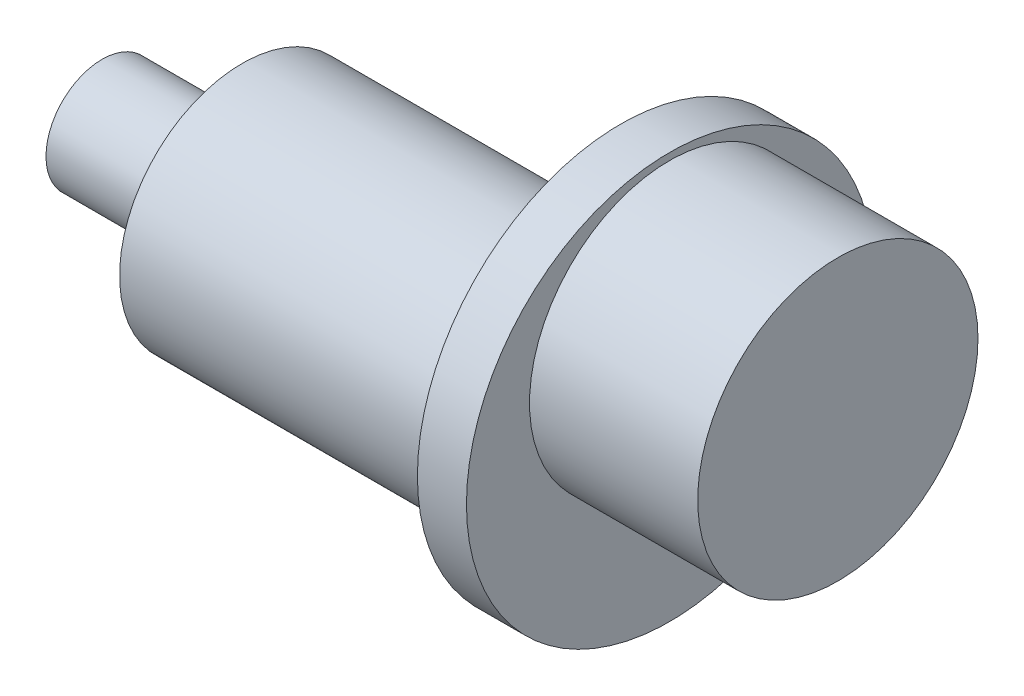
ISO-10303-21;
HEADER;
FILE_DESCRIPTION(('STEP AP214'),'2;1');
FILE_NAME('part.step','',(''),(''),'','','');
FILE_SCHEMA(('AUTOMOTIVE_DESIGN { 1 0 10303 214 1 1 1 1 }'));
ENDSEC;
DATA;
#1=APPLICATION_CONTEXT('core data for automotive mechanical design processes');
#2=APPLICATION_PROTOCOL_DEFINITION('international standard','automotive_design',2000,#1);
#3=PRODUCT_CONTEXT('',#1,'mechanical');
#4=PRODUCT('Part','Part','',(#3));
#5=PRODUCT_RELATED_PRODUCT_CATEGORY('part','',(#4));
#6=PRODUCT_DEFINITION_FORMATION('','',#4);
#7=PRODUCT_DEFINITION_CONTEXT('part definition',#1,'design');
#8=PRODUCT_DEFINITION('design','',#6,#7);
#9=PRODUCT_DEFINITION_SHAPE('','',#8);
#10=(LENGTH_UNIT() NAMED_UNIT(*) SI_UNIT(.MILLI.,.METRE.));
#11=(NAMED_UNIT(*) PLANE_ANGLE_UNIT() SI_UNIT($,.RADIAN.));
#12=(NAMED_UNIT(*) SI_UNIT($,.STERADIAN.) SOLID_ANGLE_UNIT());
#13=UNCERTAINTY_MEASURE_WITH_UNIT(LENGTH_MEASURE(1.E-05),#10,'distance_accuracy_value','');
#14=(GEOMETRIC_REPRESENTATION_CONTEXT(3) GLOBAL_UNCERTAINTY_ASSIGNED_CONTEXT((#13)) GLOBAL_UNIT_ASSIGNED_CONTEXT((#10,
#11,#12)) REPRESENTATION_CONTEXT('',''));
#15=CARTESIAN_POINT('',(0.,0.,0.));
#16=DIRECTION('',(0.,0.,1.));
#17=DIRECTION('',(1.,0.,0.));
#18=AXIS2_PLACEMENT_3D('',#15,#16,#17);
#19=CARTESIAN_POINT('',(-47.,0.,0.));
#20=DIRECTION('',(1.,0.,0.));
#21=DIRECTION('',(0.,0.,-1.));
#22=AXIS2_PLACEMENT_3D('',#19,#20,#21);
#23=CYLINDRICAL_SURFACE('',#22,17.5);
#24=CARTESIAN_POINT('',(-47.,0.,0.));
#25=DIRECTION('',(1.,0.,0.));
#26=DIRECTION('',(0.,0.,-1.));
#27=AXIS2_PLACEMENT_3D('',#24,#25,#26);
#28=CIRCLE('',#27,17.5);
#29=CARTESIAN_POINT('',(-47.,0.,-17.5));
#30=VERTEX_POINT('',#29);
#31=EDGE_CURVE('E38',#30,#30,#28,.T.);
#32=ORIENTED_EDGE('',*,*,#31,.T.);
#33=EDGE_LOOP('',(#32));
#34=FACE_BOUND('',#33,.T.);
#35=CARTESIAN_POINT('',(0.,0.,0.));
#36=DIRECTION('',(1.,0.,0.));
#37=DIRECTION('',(0.,0.,-1.));
#38=AXIS2_PLACEMENT_3D('',#35,#36,#37);
#39=CIRCLE('',#38,17.5);
#40=CARTESIAN_POINT('',(0.,0.,-17.5));
#41=VERTEX_POINT('',#40);
#42=EDGE_CURVE('E42',#41,#41,#39,.T.);
#43=ORIENTED_EDGE('',*,*,#42,.F.);
#44=EDGE_LOOP('',(#43));
#45=FACE_BOUND('',#44,.T.);
#46=ADVANCED_FACE('F32',(#34,#45),#23,.T.);
#47=CARTESIAN_POINT('',(-47.,0.,0.));
#48=DIRECTION('',(1.,0.,0.));
#49=DIRECTION('',(0.,0.,-1.));
#50=AXIS2_PLACEMENT_3D('',#47,#48,#49);
#51=PLANE('',#50);
#52=CARTESIAN_POINT('',(-47.,0.,0.));
#53=DIRECTION('',(1.,0.,0.));
#54=DIRECTION('',(0.,0.,-1.));
#55=AXIS2_PLACEMENT_3D('',#52,#53,#54);
#56=CIRCLE('',#55,8.);
#57=CARTESIAN_POINT('',(-47.,0.,-8.));
#58=VERTEX_POINT('',#57);
#59=EDGE_CURVE('E10',#58,#58,#56,.F.);
#60=ORIENTED_EDGE('',*,*,#59,.F.);
#61=EDGE_LOOP('',(#60));
#62=FACE_BOUND('',#61,.T.);
#63=ORIENTED_EDGE('',*,*,#31,.F.);
#64=EDGE_LOOP('',(#63));
#65=FACE_BOUND('',#64,.T.);
#66=ADVANCED_FACE('F98',(#62,#65),#51,.F.);
#67=CARTESIAN_POINT('',(-67.,0.,0.));
#68=DIRECTION('',(1.,0.,0.));
#69=DIRECTION('',(0.,0.,-1.));
#70=AXIS2_PLACEMENT_3D('',#67,#68,#69);
#71=CYLINDRICAL_SURFACE('',#70,8.);
#72=CARTESIAN_POINT('',(-67.,0.,0.));
#73=DIRECTION('',(-1.,0.,0.));
#74=DIRECTION('',(0.,0.,1.));
#75=AXIS2_PLACEMENT_3D('',#72,#73,#74);
#76=CIRCLE('',#75,8.);
#77=CARTESIAN_POINT('',(-67.,0.,8.));
#78=VERTEX_POINT('',#77);
#79=EDGE_CURVE('E47',#78,#78,#76,.T.);
#80=ORIENTED_EDGE('',*,*,#79,.F.);
#81=EDGE_LOOP('',(#80));
#82=FACE_BOUND('',#81,.T.);
#83=ORIENTED_EDGE('',*,*,#59,.T.);
#84=EDGE_LOOP('',(#83));
#85=FACE_BOUND('',#84,.T.);
#86=ADVANCED_FACE('F102',(#82,#85),#71,.T.);
#87=CARTESIAN_POINT('',(-67.,0.,0.));
#88=DIRECTION('',(-1.,0.,0.));
#89=DIRECTION('',(0.,0.,1.));
#90=AXIS2_PLACEMENT_3D('',#87,#88,#89);
#91=PLANE('',#90);
#92=ORIENTED_EDGE('',*,*,#79,.T.);
#93=EDGE_LOOP('',(#92));
#94=FACE_BOUND('',#93,.T.);
#95=ADVANCED_FACE('F114',(#94),#91,.T.);
#96=CARTESIAN_POINT('',(7.,0.,0.));
#97=DIRECTION('',(-1.,0.,0.));
#98=DIRECTION('',(0.,0.,1.));
#99=AXIS2_PLACEMENT_3D('',#96,#97,#98);
#100=CYLINDRICAL_SURFACE('',#99,20.5);
#101=CARTESIAN_POINT('',(7.,0.,0.));
#102=DIRECTION('',(1.,0.,0.));
#103=DIRECTION('',(0.,0.,-1.));
#104=AXIS2_PLACEMENT_3D('',#101,#102,#103);
#105=CIRCLE('',#104,20.5);
#106=CARTESIAN_POINT('',(7.,0.,-20.5));
#107=VERTEX_POINT('',#106);
#108=EDGE_CURVE('E51',#107,#107,#105,.T.);
#109=ORIENTED_EDGE('',*,*,#108,.F.);
#110=EDGE_LOOP('',(#109));
#111=FACE_BOUND('',#110,.T.);
#112=CARTESIAN_POINT('',(0.,0.,0.));
#113=DIRECTION('',(1.,0.,0.));
#114=DIRECTION('',(0.,0.,-1.));
#115=AXIS2_PLACEMENT_3D('',#112,#113,#114);
#116=CIRCLE('',#115,20.5);
#117=CARTESIAN_POINT('',(0.,0.,-20.5));
#118=VERTEX_POINT('',#117);
#119=EDGE_CURVE('E52',#118,#118,#116,.T.);
#120=ORIENTED_EDGE('',*,*,#119,.T.);
#121=EDGE_LOOP('',(#120));
#122=FACE_BOUND('',#121,.T.);
#123=ADVANCED_FACE('F109',(#111,#122),#100,.T.);
#124=CARTESIAN_POINT('',(0.,0.,0.));
#125=DIRECTION('',(1.,0.,0.));
#126=DIRECTION('',(0.,0.,-1.));
#127=AXIS2_PLACEMENT_3D('',#124,#125,#126);
#128=PLANE('',#127);
#129=ORIENTED_EDGE('',*,*,#42,.T.);
#130=EDGE_LOOP('',(#129));
#131=FACE_BOUND('',#130,.T.);
#132=ORIENTED_EDGE('',*,*,#119,.F.);
#133=EDGE_LOOP('',(#132));
#134=FACE_BOUND('',#133,.T.);
#135=ADVANCED_FACE('F88',(#131,#134),#128,.F.);
#136=CARTESIAN_POINT('',(14.,8.,0.));
#137=DIRECTION('',(-1.,0.,0.));
#138=DIRECTION('',(0.,0.,1.));
#139=AXIS2_PLACEMENT_3D('',#136,#137,#138);
#140=CYLINDRICAL_SURFACE('',#139,29.);
#141=CARTESIAN_POINT('',(14.,8.,0.));
#142=DIRECTION('',(1.,0.,0.));
#143=DIRECTION('',(0.,0.,-1.));
#144=AXIS2_PLACEMENT_3D('',#141,#142,#143);
#145=CIRCLE('',#144,29.);
#146=CARTESIAN_POINT('',(14.,8.,-29.));
#147=VERTEX_POINT('',#146);
#148=EDGE_CURVE('E55',#147,#147,#145,.T.);
#149=ORIENTED_EDGE('',*,*,#148,.F.);
#150=EDGE_LOOP('',(#149));
#151=FACE_BOUND('',#150,.T.);
#152=CARTESIAN_POINT('',(7.,8.,0.));
#153=DIRECTION('',(1.,0.,0.));
#154=DIRECTION('',(0.,0.,-1.));
#155=AXIS2_PLACEMENT_3D('',#152,#153,#154);
#156=CIRCLE('',#155,29.);
#157=CARTESIAN_POINT('',(7.,8.,-29.));
#158=VERTEX_POINT('',#157);
#159=EDGE_CURVE('E58',#158,#158,#156,.T.);
#160=ORIENTED_EDGE('',*,*,#159,.T.);
#161=EDGE_LOOP('',(#160));
#162=FACE_BOUND('',#161,.T.);
#163=ADVANCED_FACE('F82',(#151,#162),#140,.T.);
#164=CARTESIAN_POINT('',(14.,8.,0.));
#165=DIRECTION('',(1.,0.,0.));
#166=DIRECTION('',(0.,0.,-1.));
#167=AXIS2_PLACEMENT_3D('',#164,#165,#166);
#168=PLANE('',#167);
#169=CARTESIAN_POINT('',(14.,16.,0.));
#170=DIRECTION('',(1.,0.,0.));
#171=DIRECTION('',(0.,0.,-1.));
#172=AXIS2_PLACEMENT_3D('',#169,#170,#171);
#173=CIRCLE('',#172,20.);
#174=CARTESIAN_POINT('',(14.,16.,-20.));
#175=VERTEX_POINT('',#174);
#176=EDGE_CURVE('E64',#175,#175,#173,.T.);
#177=ORIENTED_EDGE('',*,*,#176,.F.);
#178=EDGE_LOOP('',(#177));
#179=FACE_BOUND('',#178,.T.);
#180=ORIENTED_EDGE('',*,*,#148,.T.);
#181=EDGE_LOOP('',(#180));
#182=FACE_BOUND('',#181,.T.);
#183=ADVANCED_FACE('F79',(#179,#182),#168,.T.);
#184=CARTESIAN_POINT('',(7.,8.,0.));
#185=DIRECTION('',(1.,0.,0.));
#186=DIRECTION('',(0.,0.,-1.));
#187=AXIS2_PLACEMENT_3D('',#184,#185,#186);
#188=PLANE('',#187);
#189=ORIENTED_EDGE('',*,*,#108,.T.);
#190=EDGE_LOOP('',(#189));
#191=FACE_BOUND('',#190,.T.);
#192=ORIENTED_EDGE('',*,*,#159,.F.);
#193=EDGE_LOOP('',(#192));
#194=FACE_BOUND('',#193,.T.);
#195=ADVANCED_FACE('F75',(#191,#194),#188,.F.);
#196=CARTESIAN_POINT('',(38.,16.,0.));
#197=DIRECTION('',(-1.,0.,0.));
#198=DIRECTION('',(0.,0.,1.));
#199=AXIS2_PLACEMENT_3D('',#196,#197,#198);
#200=CYLINDRICAL_SURFACE('',#199,20.);
#201=CARTESIAN_POINT('',(38.,16.,0.));
#202=DIRECTION('',(1.,0.,0.));
#203=DIRECTION('',(0.,0.,-1.));
#204=AXIS2_PLACEMENT_3D('',#201,#202,#203);
#205=CIRCLE('',#204,20.);
#206=CARTESIAN_POINT('',(38.,16.,-20.));
#207=VERTEX_POINT('',#206);
#208=EDGE_CURVE('E61',#207,#207,#205,.T.);
#209=ORIENTED_EDGE('',*,*,#208,.F.);
#210=EDGE_LOOP('',(#209));
#211=FACE_BOUND('',#210,.T.);
#212=ORIENTED_EDGE('',*,*,#176,.T.);
#213=EDGE_LOOP('',(#212));
#214=FACE_BOUND('',#213,.T.);
#215=ADVANCED_FACE('F72',(#211,#214),#200,.T.);
#216=CARTESIAN_POINT('',(38.,16.,0.));
#217=DIRECTION('',(1.,0.,0.));
#218=DIRECTION('',(0.,0.,-1.));
#219=AXIS2_PLACEMENT_3D('',#216,#217,#218);
#220=PLANE('',#219);
#221=ORIENTED_EDGE('',*,*,#208,.T.);
#222=EDGE_LOOP('',(#221));
#223=FACE_BOUND('',#222,.T.);
#224=ADVANCED_FACE('F70',(#223),#220,.T.);
#225=CLOSED_SHELL('',(#46,#66,#86,#95,#123,#135,#163,#183,#195,#215,#224));
#226=MANIFOLD_SOLID_BREP('B2',#225);
#227=ADVANCED_BREP_SHAPE_REPRESENTATION('',(#18,#226),#14);
#228=SHAPE_DEFINITION_REPRESENTATION(#9,#227);
ENDSEC;
END-ISO-10303-21;
